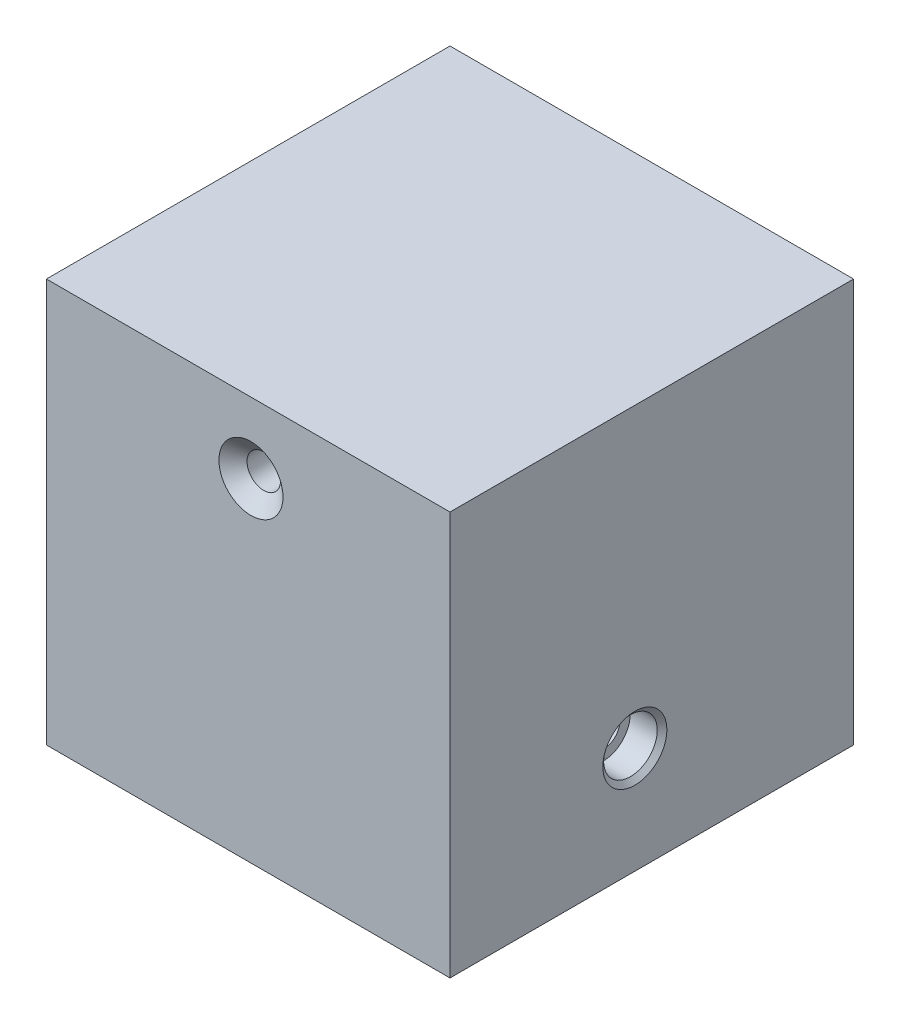
ISO-10303-21;
HEADER;
FILE_DESCRIPTION(('STEP AP214'),'2;1');
FILE_NAME('part.step','',(''),(''),'','','');
FILE_SCHEMA(('AUTOMOTIVE_DESIGN { 1 0 10303 214 1 1 1 1 }'));
ENDSEC;
DATA;
#1=APPLICATION_CONTEXT('core data for automotive mechanical design processes');
#2=APPLICATION_PROTOCOL_DEFINITION('international standard','automotive_design',2000,#1);
#3=PRODUCT_CONTEXT('',#1,'mechanical');
#4=PRODUCT('Part','Part','',(#3));
#5=PRODUCT_RELATED_PRODUCT_CATEGORY('part','',(#4));
#6=PRODUCT_DEFINITION_FORMATION('','',#4);
#7=PRODUCT_DEFINITION_CONTEXT('part definition',#1,'design');
#8=PRODUCT_DEFINITION('design','',#6,#7);
#9=PRODUCT_DEFINITION_SHAPE('','',#8);
#10=(LENGTH_UNIT() NAMED_UNIT(*) SI_UNIT(.MILLI.,.METRE.));
#11=(NAMED_UNIT(*) PLANE_ANGLE_UNIT() SI_UNIT($,.RADIAN.));
#12=(NAMED_UNIT(*) SI_UNIT($,.STERADIAN.) SOLID_ANGLE_UNIT());
#13=UNCERTAINTY_MEASURE_WITH_UNIT(LENGTH_MEASURE(1.E-05),#10,'distance_accuracy_value','');
#14=(GEOMETRIC_REPRESENTATION_CONTEXT(3) GLOBAL_UNCERTAINTY_ASSIGNED_CONTEXT((#13)) GLOBAL_UNIT_ASSIGNED_CONTEXT((#10,
#11,#12)) REPRESENTATION_CONTEXT('',''));
#15=CARTESIAN_POINT('',(0.,0.,0.));
#16=DIRECTION('',(0.,0.,1.));
#17=DIRECTION('',(1.,0.,0.));
#18=AXIS2_PLACEMENT_3D('',#15,#16,#17);
#19=CARTESIAN_POINT('',(101.6,26.8232451806077,55.0625341901142));
#20=DIRECTION('',(1.,0.,0.));
#21=DIRECTION('',(0.,0.,-1.));
#22=AXIS2_PLACEMENT_3D('',#19,#20,#21);
#23=CYLINDRICAL_SURFACE('',#22,4.21639999999999);
#24=CARTESIAN_POINT('',(12.7,26.8232451806077,55.0625341901142));
#25=DIRECTION('',(-1.,0.,0.));
#26=DIRECTION('',(0.,0.,1.));
#27=AXIS2_PLACEMENT_3D('',#24,#25,#26);
#28=CIRCLE('',#27,4.21639999999999);
#29=CARTESIAN_POINT('',(12.7,26.8232451806077,59.2789341901142));
#30=VERTEX_POINT('',#29);
#31=EDGE_CURVE('E120',#30,#30,#28,.F.);
#32=ORIENTED_EDGE('',*,*,#31,.F.);
#33=EDGE_LOOP('',(#32));
#34=FACE_BOUND('',#33,.T.);
#35=CARTESIAN_POINT('',(50.673,26.8232451806077,55.0625341901142));
#36=DIRECTION('',(1.,0.,0.));
#37=DIRECTION('',(0.,0.,-1.));
#38=AXIS2_PLACEMENT_3D('',#35,#36,#37);
#39=CIRCLE('',#38,4.21639999999999);
#40=CARTESIAN_POINT('',(50.673,26.8232451806077,50.8461341901142));
#41=VERTEX_POINT('',#40);
#42=EDGE_CURVE('E11',#41,#41,#39,.F.);
#43=ORIENTED_EDGE('',*,*,#42,.F.);
#44=EDGE_LOOP('',(#43));
#45=FACE_BOUND('',#44,.T.);
#46=ADVANCED_FACE('F41',(#34,#45),#23,.F.);
#47=CARTESIAN_POINT('',(50.927,26.8232451806077,55.0625341901142));
#48=DIRECTION('',(1.,0.,0.));
#49=DIRECTION('',(0.,0.,-1.));
#50=AXIS2_PLACEMENT_3D('',#47,#48,#49);
#51=CIRCLE('',#50,4.2164);
#52=CARTESIAN_POINT('',(50.927,26.8232451806077,50.8461341901142));
#53=VERTEX_POINT('',#52);
#54=EDGE_CURVE('E145',#53,#53,#51,.T.);
#55=ORIENTED_EDGE('',*,*,#54,.F.);
#56=EDGE_LOOP('',(#55));
#57=FACE_BOUND('',#56,.T.);
#58=CARTESIAN_POINT('',(93.6625,26.8232451806077,55.0625341901142));
#59=DIRECTION('',(1.,0.,0.));
#60=DIRECTION('',(0.,0.,-1.));
#61=AXIS2_PLACEMENT_3D('',#58,#59,#60);
#62=CIRCLE('',#61,4.21640000000001);
#63=CARTESIAN_POINT('',(93.6625,26.8232451806077,50.8461341901142));
#64=VERTEX_POINT('',#63);
#65=EDGE_CURVE('E158',#64,#64,#62,.T.);
#66=ORIENTED_EDGE('',*,*,#65,.T.);
#67=EDGE_LOOP('',(#66));
#68=FACE_BOUND('',#67,.T.);
#69=ADVANCED_FACE('F201',(#57,#68),#23,.F.);
#70=CARTESIAN_POINT('',(0.,0.,101.6));
#71=DIRECTION('',(1.,0.,0.));
#72=DIRECTION('',(0.,0.,-1.));
#73=AXIS2_PLACEMENT_3D('',#70,#71,#72);
#74=PLANE('',#73);
#75=CARTESIAN_POINT('',(0.,26.8232451806077,55.0625341901142));
#76=DIRECTION('',(1.,0.,0.));
#77=DIRECTION('',(0.,0.,-1.));
#78=AXIS2_PLACEMENT_3D('',#75,#76,#77);
#79=CIRCLE('',#78,9.46277456392465);
#80=CARTESIAN_POINT('',(0.,26.8232451806077,45.5997596261896));
#81=VERTEX_POINT('',#80);
#82=EDGE_CURVE('E50',#81,#81,#79,.T.);
#83=ORIENTED_EDGE('',*,*,#82,.T.);
#84=EDGE_LOOP('',(#83));
#85=FACE_BOUND('',#84,.T.);
#86=DIRECTION('',(0.,-1.,0.));
#87=VECTOR('',#86,1.);
#88=CARTESIAN_POINT('',(0.,0.,0.));
#89=LINE('',#88,#87);
#90=CARTESIAN_POINT('',(0.,101.6,0.));
#91=VERTEX_POINT('',#90);
#92=CARTESIAN_POINT('',(0.,0.,0.));
#93=VERTEX_POINT('',#92);
#94=EDGE_CURVE('E109',#91,#93,#89,.T.);
#95=ORIENTED_EDGE('',*,*,#94,.T.);
#96=DIRECTION('',(0.,0.,-1.));
#97=VECTOR('',#96,1.);
#98=CARTESIAN_POINT('',(0.,0.,101.6));
#99=LINE('',#98,#97);
#100=CARTESIAN_POINT('',(0.,0.,101.6));
#101=VERTEX_POINT('',#100);
#102=EDGE_CURVE('E100',#101,#93,#99,.T.);
#103=ORIENTED_EDGE('',*,*,#102,.F.);
#104=DIRECTION('',(0.,-1.,0.));
#105=VECTOR('',#104,1.);
#106=CARTESIAN_POINT('',(0.,0.,101.6));
#107=LINE('',#106,#105);
#108=CARTESIAN_POINT('',(0.,101.6,101.6));
#109=VERTEX_POINT('',#108);
#110=EDGE_CURVE('E94',#109,#101,#107,.T.);
#111=ORIENTED_EDGE('',*,*,#110,.F.);
#112=DIRECTION('',(0.,0.,-1.));
#113=VECTOR('',#112,1.);
#114=CARTESIAN_POINT('',(0.,101.6,101.6));
#115=LINE('',#114,#113);
#116=EDGE_CURVE('E105',#109,#91,#115,.T.);
#117=ORIENTED_EDGE('',*,*,#116,.T.);
#118=EDGE_LOOP('',(#95,#103,#111,#117));
#119=FACE_BOUND('',#118,.T.);
#120=ADVANCED_FACE('F129',(#85,#119),#74,.F.);
#121=CARTESIAN_POINT('',(0.,0.,101.6));
#122=DIRECTION('',(0.,1.,0.));
#123=DIRECTION('',(0.,0.,1.));
#124=AXIS2_PLACEMENT_3D('',#121,#122,#123);
#125=PLANE('',#124);
#126=DIRECTION('',(1.,0.,0.));
#127=VECTOR('',#126,1.);
#128=CARTESIAN_POINT('',(0.,0.,0.));
#129=LINE('',#128,#127);
#130=CARTESIAN_POINT('',(101.6,0.,0.));
#131=VERTEX_POINT('',#130);
#132=EDGE_CURVE('E99',#93,#131,#129,.T.);
#133=ORIENTED_EDGE('',*,*,#132,.T.);
#134=DIRECTION('',(0.,0.,-1.));
#135=VECTOR('',#134,1.);
#136=CARTESIAN_POINT('',(101.6,0.,101.6));
#137=LINE('',#136,#135);
#138=CARTESIAN_POINT('',(101.6,0.,101.6));
#139=VERTEX_POINT('',#138);
#140=EDGE_CURVE('E97',#139,#131,#137,.T.);
#141=ORIENTED_EDGE('',*,*,#140,.F.);
#142=DIRECTION('',(1.,0.,0.));
#143=VECTOR('',#142,1.);
#144=CARTESIAN_POINT('',(0.,0.,101.6));
#145=LINE('',#144,#143);
#146=EDGE_CURVE('E89',#101,#139,#145,.T.);
#147=ORIENTED_EDGE('',*,*,#146,.F.);
#148=ORIENTED_EDGE('',*,*,#102,.T.);
#149=EDGE_LOOP('',(#133,#141,#147,#148));
#150=FACE_BOUND('',#149,.T.);
#151=ADVANCED_FACE('F98',(#150),#125,.F.);
#152=CARTESIAN_POINT('',(101.6,0.,101.6));
#153=DIRECTION('',(-1.,0.,0.));
#154=DIRECTION('',(0.,0.,1.));
#155=AXIS2_PLACEMENT_3D('',#152,#153,#154);
#156=PLANE('',#155);
#157=CARTESIAN_POINT('',(101.6,26.8232451806077,55.0625341901142));
#158=DIRECTION('',(1.,0.,0.));
#159=DIRECTION('',(0.,0.,-1.));
#160=AXIS2_PLACEMENT_3D('',#157,#158,#159);
#161=CIRCLE('',#160,8.06450000000001);
#162=CARTESIAN_POINT('',(101.6,26.8232451806077,46.9980341901142));
#163=VERTEX_POINT('',#162);
#164=EDGE_CURVE('E123',#163,#163,#161,.T.);
#165=ORIENTED_EDGE('',*,*,#164,.F.);
#166=EDGE_LOOP('',(#165));
#167=FACE_BOUND('',#166,.T.);
#168=DIRECTION('',(0.,1.,0.));
#169=VECTOR('',#168,1.);
#170=CARTESIAN_POINT('',(101.6,0.,0.));
#171=LINE('',#170,#169);
#172=CARTESIAN_POINT('',(101.6,101.6,0.));
#173=VERTEX_POINT('',#172);
#174=EDGE_CURVE('E75',#131,#173,#171,.T.);
#175=ORIENTED_EDGE('',*,*,#174,.T.);
#176=DIRECTION('',(0.,0.,-1.));
#177=VECTOR('',#176,1.);
#178=CARTESIAN_POINT('',(101.6,101.6,101.6));
#179=LINE('',#178,#177);
#180=CARTESIAN_POINT('',(101.6,101.6,101.6));
#181=VERTEX_POINT('',#180);
#182=EDGE_CURVE('E101',#181,#173,#179,.T.);
#183=ORIENTED_EDGE('',*,*,#182,.F.);
#184=DIRECTION('',(0.,1.,0.));
#185=VECTOR('',#184,1.);
#186=CARTESIAN_POINT('',(101.6,0.,101.6));
#187=LINE('',#186,#185);
#188=EDGE_CURVE('E92',#139,#181,#187,.T.);
#189=ORIENTED_EDGE('',*,*,#188,.F.);
#190=ORIENTED_EDGE('',*,*,#140,.T.);
#191=EDGE_LOOP('',(#175,#183,#189,#190));
#192=FACE_BOUND('',#191,.T.);
#193=ADVANCED_FACE('F103',(#167,#192),#156,.F.);
#194=CARTESIAN_POINT('',(0.,101.6,101.6));
#195=DIRECTION('',(0.,-1.,0.));
#196=DIRECTION('',(0.,0.,-1.));
#197=AXIS2_PLACEMENT_3D('',#194,#195,#196);
#198=PLANE('',#197);
#199=DIRECTION('',(-1.,0.,0.));
#200=VECTOR('',#199,1.);
#201=CARTESIAN_POINT('',(0.,101.6,0.));
#202=LINE('',#201,#200);
#203=EDGE_CURVE('E81',#173,#91,#202,.T.);
#204=ORIENTED_EDGE('',*,*,#203,.T.);
#205=ORIENTED_EDGE('',*,*,#116,.F.);
#206=DIRECTION('',(-1.,0.,0.));
#207=VECTOR('',#206,1.);
#208=CARTESIAN_POINT('',(0.,101.6,101.6));
#209=LINE('',#208,#207);
#210=EDGE_CURVE('E58',#181,#109,#209,.T.);
#211=ORIENTED_EDGE('',*,*,#210,.F.);
#212=ORIENTED_EDGE('',*,*,#182,.T.);
#213=EDGE_LOOP('',(#204,#205,#211,#212));
#214=FACE_BOUND('',#213,.T.);
#215=ADVANCED_FACE('F190',(#214),#198,.F.);
#216=CARTESIAN_POINT('',(0.,0.,101.6));
#217=DIRECTION('',(0.,0.,-1.));
#218=DIRECTION('',(-1.,0.,0.));
#219=AXIS2_PLACEMENT_3D('',#216,#217,#218);
#220=PLANE('',#219);
#221=CARTESIAN_POINT('',(51.4900872333897,83.8414821838995,101.6));
#222=DIRECTION('',(0.,0.,1.));
#223=DIRECTION('',(1.,0.,0.));
#224=AXIS2_PLACEMENT_3D('',#221,#222,#223);
#225=CIRCLE('',#224,8.0645);
#226=CARTESIAN_POINT('',(59.5545872333897,83.8414821838995,101.6));
#227=VERTEX_POINT('',#226);
#228=EDGE_CURVE('E164',#227,#227,#225,.T.);
#229=ORIENTED_EDGE('',*,*,#228,.F.);
#230=EDGE_LOOP('',(#229));
#231=FACE_BOUND('',#230,.T.);
#232=ORIENTED_EDGE('',*,*,#110,.T.);
#233=ORIENTED_EDGE('',*,*,#146,.T.);
#234=ORIENTED_EDGE('',*,*,#188,.T.);
#235=ORIENTED_EDGE('',*,*,#210,.T.);
#236=EDGE_LOOP('',(#232,#233,#234,#235));
#237=FACE_BOUND('',#236,.T.);
#238=ADVANCED_FACE('F90',(#231,#237),#220,.F.);
#239=CARTESIAN_POINT('',(0.,0.,0.));
#240=DIRECTION('',(0.,0.,-1.));
#241=DIRECTION('',(-1.,0.,0.));
#242=AXIS2_PLACEMENT_3D('',#239,#240,#241);
#243=PLANE('',#242);
#244=CARTESIAN_POINT('',(51.4900872333897,83.8414821838995,0.));
#245=DIRECTION('',(0.,0.,1.));
#246=DIRECTION('',(1.,0.,0.));
#247=AXIS2_PLACEMENT_3D('',#244,#245,#246);
#248=CIRCLE('',#247,8.06449999999997);
#249=CARTESIAN_POINT('',(59.5545872333896,83.8414821838995,0.));
#250=VERTEX_POINT('',#249);
#251=EDGE_CURVE('E161',#250,#250,#248,.T.);
#252=ORIENTED_EDGE('',*,*,#251,.T.);
#253=EDGE_LOOP('',(#252));
#254=FACE_BOUND('',#253,.T.);
#255=ORIENTED_EDGE('',*,*,#94,.F.);
#256=ORIENTED_EDGE('',*,*,#203,.F.);
#257=ORIENTED_EDGE('',*,*,#174,.F.);
#258=ORIENTED_EDGE('',*,*,#132,.F.);
#259=EDGE_LOOP('',(#255,#256,#257,#258));
#260=FACE_BOUND('',#259,.T.);
#261=ADVANCED_FACE('F189',(#254,#260),#243,.T.);
#262=CARTESIAN_POINT('',(51.4900872333897,83.8414821838995,3.22893929073329));
#263=DIRECTION('',(0.,0.,-1.));
#264=DIRECTION('',(-1.,0.,0.));
#265=AXIS2_PLACEMENT_3D('',#262,#263,#264);
#266=CONICAL_SURFACE('',#265,4.21639999999998,0.872664625997165);
#267=ORIENTED_EDGE('',*,*,#251,.F.);
#268=EDGE_LOOP('',(#267));
#269=FACE_BOUND('',#268,.T.);
#270=CARTESIAN_POINT('',(51.4900872333897,83.8414821838995,3.22893929073329));
#271=DIRECTION('',(0.,0.,1.));
#272=DIRECTION('',(1.,0.,0.));
#273=AXIS2_PLACEMENT_3D('',#270,#271,#272);
#274=CIRCLE('',#273,4.21639999999998);
#275=CARTESIAN_POINT('',(55.7064872333896,83.8414821838995,3.22893929073329));
#276=VERTEX_POINT('',#275);
#277=EDGE_CURVE('E112',#276,#276,#274,.T.);
#278=ORIENTED_EDGE('',*,*,#277,.T.);
#279=EDGE_LOOP('',(#278));
#280=FACE_BOUND('',#279,.T.);
#281=ADVANCED_FACE('F173',(#269,#280),#266,.F.);
#282=CARTESIAN_POINT('',(51.4900872333897,83.8414821838995,101.6));
#283=DIRECTION('',(0.,0.,1.));
#284=DIRECTION('',(1.,0.,0.));
#285=AXIS2_PLACEMENT_3D('',#282,#283,#284);
#286=CYLINDRICAL_SURFACE('',#285,4.21639999999999);
#287=ORIENTED_EDGE('',*,*,#277,.F.);
#288=EDGE_LOOP('',(#287));
#289=FACE_BOUND('',#288,.T.);
#290=CARTESIAN_POINT('',(51.4900872333897,83.8414821838995,98.3710607092667));
#291=DIRECTION('',(0.,0.,1.));
#292=DIRECTION('',(1.,0.,0.));
#293=AXIS2_PLACEMENT_3D('',#290,#291,#292);
#294=CIRCLE('',#293,4.21639999999999);
#295=CARTESIAN_POINT('',(55.7064872333897,83.8414821838995,98.3710607092667));
#296=VERTEX_POINT('',#295);
#297=EDGE_CURVE('E167',#296,#296,#294,.T.);
#298=ORIENTED_EDGE('',*,*,#297,.T.);
#299=EDGE_LOOP('',(#298));
#300=FACE_BOUND('',#299,.T.);
#301=ADVANCED_FACE('F175',(#289,#300),#286,.F.);
#302=CARTESIAN_POINT('',(51.4900872333897,83.8414821838995,101.6));
#303=DIRECTION('',(0.,0.,1.));
#304=DIRECTION('',(1.,0.,0.));
#305=AXIS2_PLACEMENT_3D('',#302,#303,#304);
#306=CONICAL_SURFACE('',#305,8.0645,0.872664625997167);
#307=ORIENTED_EDGE('',*,*,#297,.F.);
#308=EDGE_LOOP('',(#307));
#309=FACE_BOUND('',#308,.T.);
#310=ORIENTED_EDGE('',*,*,#228,.T.);
#311=EDGE_LOOP('',(#310));
#312=FACE_BOUND('',#311,.T.);
#313=ADVANCED_FACE('F178',(#309,#312),#306,.F.);
#314=CARTESIAN_POINT('',(93.6625,33.5707551806077,55.0625341901142));
#315=DIRECTION('',(-1.,0.,0.));
#316=DIRECTION('',(0.,0.,1.));
#317=AXIS2_PLACEMENT_3D('',#314,#315,#316);
#318=PLANE('',#317);
#319=ORIENTED_EDGE('',*,*,#65,.F.);
#320=EDGE_LOOP('',(#319));
#321=FACE_BOUND('',#320,.T.);
#322=CARTESIAN_POINT('',(93.6625,26.8232451806077,55.0625341901142));
#323=DIRECTION('',(1.,0.,0.));
#324=DIRECTION('',(0.,0.,-1.));
#325=AXIS2_PLACEMENT_3D('',#322,#323,#324);
#326=CIRCLE('',#325,6.74750999999999);
#327=CARTESIAN_POINT('',(93.6625,26.8232451806077,48.3150241901142));
#328=VERTEX_POINT('',#327);
#329=EDGE_CURVE('E155',#328,#328,#326,.T.);
#330=ORIENTED_EDGE('',*,*,#329,.T.);
#331=EDGE_LOOP('',(#330));
#332=FACE_BOUND('',#331,.T.);
#333=ADVANCED_FACE('F184',(#321,#332),#318,.F.);
#334=CARTESIAN_POINT('',(101.6,26.8232451806077,55.0625341901142));
#335=DIRECTION('',(1.,0.,0.));
#336=DIRECTION('',(0.,0.,-1.));
#337=AXIS2_PLACEMENT_3D('',#334,#335,#336);
#338=CYLINDRICAL_SURFACE('',#337,6.74751);
#339=ORIENTED_EDGE('',*,*,#329,.F.);
#340=EDGE_LOOP('',(#339));
#341=FACE_BOUND('',#340,.T.);
#342=CARTESIAN_POINT('',(100.494914176736,26.8232451806077,55.0625341901142));
#343=DIRECTION('',(1.,0.,0.));
#344=DIRECTION('',(0.,0.,-1.));
#345=AXIS2_PLACEMENT_3D('',#342,#343,#344);
#346=CIRCLE('',#345,6.74751);
#347=CARTESIAN_POINT('',(100.494914176736,26.8232451806077,48.3150241901142));
#348=VERTEX_POINT('',#347);
#349=EDGE_CURVE('E152',#348,#348,#346,.T.);
#350=ORIENTED_EDGE('',*,*,#349,.T.);
#351=EDGE_LOOP('',(#350));
#352=FACE_BOUND('',#351,.T.);
#353=ADVANCED_FACE('F233',(#341,#352),#338,.F.);
#354=CARTESIAN_POINT('',(101.6,26.8232451806077,55.0625341901142));
#355=DIRECTION('',(1.,0.,0.));
#356=DIRECTION('',(0.,0.,-1.));
#357=AXIS2_PLACEMENT_3D('',#354,#355,#356);
#358=CONICAL_SURFACE('',#357,8.06450000000001,0.872664625997164);
#359=ORIENTED_EDGE('',*,*,#349,.F.);
#360=EDGE_LOOP('',(#359));
#361=FACE_BOUND('',#360,.T.);
#362=ORIENTED_EDGE('',*,*,#164,.T.);
#363=EDGE_LOOP('',(#362));
#364=FACE_BOUND('',#363,.T.);
#365=ADVANCED_FACE('F231',(#361,#364),#358,.F.);
#366=CARTESIAN_POINT('',(12.7,26.8232451806077,55.0625341901142));
#367=DIRECTION('',(-1.,0.,0.));
#368=DIRECTION('',(0.,0.,1.));
#369=AXIS2_PLACEMENT_3D('',#366,#367,#368);
#370=PLANE('',#369);
#371=CARTESIAN_POINT('',(12.7,26.8232451806077,55.0625341901142));
#372=DIRECTION('',(-1.,0.,0.));
#373=DIRECTION('',(0.,0.,1.));
#374=AXIS2_PLACEMENT_3D('',#371,#372,#373);
#375=CIRCLE('',#374,6.92277456392466);
#376=CARTESIAN_POINT('',(12.7,26.8232451806077,61.9853087540389));
#377=VERTEX_POINT('',#376);
#378=EDGE_CURVE('E124',#377,#377,#375,.T.);
#379=ORIENTED_EDGE('',*,*,#378,.T.);
#380=EDGE_LOOP('',(#379));
#381=FACE_BOUND('',#380,.T.);
#382=ORIENTED_EDGE('',*,*,#31,.T.);
#383=EDGE_LOOP('',(#382));
#384=FACE_BOUND('',#383,.T.);
#385=ADVANCED_FACE('F140',(#381,#384),#370,.T.);
#386=CARTESIAN_POINT('',(12.7,26.8232451806077,55.0625341901142));
#387=DIRECTION('',(-1.,0.,0.));
#388=DIRECTION('',(0.,0.,1.));
#389=AXIS2_PLACEMENT_3D('',#386,#387,#388);
#390=CYLINDRICAL_SURFACE('',#389,6.92277456392466);
#391=CARTESIAN_POINT('',(2.53999999999997,26.8232451806077,55.0625341901142));
#392=DIRECTION('',(1.,0.,0.));
#393=DIRECTION('',(0.,0.,-1.));
#394=AXIS2_PLACEMENT_3D('',#391,#392,#393);
#395=CIRCLE('',#394,6.92277456392466);
#396=CARTESIAN_POINT('',(2.53999999999997,26.8232451806077,48.1397596261896));
#397=VERTEX_POINT('',#396);
#398=EDGE_CURVE('E119',#397,#397,#395,.F.);
#399=ORIENTED_EDGE('',*,*,#398,.T.);
#400=EDGE_LOOP('',(#399));
#401=FACE_BOUND('',#400,.T.);
#402=ORIENTED_EDGE('',*,*,#378,.F.);
#403=EDGE_LOOP('',(#402));
#404=FACE_BOUND('',#403,.T.);
#405=ADVANCED_FACE('F135',(#401,#404),#390,.F.);
#406=CARTESIAN_POINT('',(2.53999999999997,26.8232451806077,55.0625341901142));
#407=DIRECTION('',(-1.,0.,0.));
#408=DIRECTION('',(0.,0.,1.));
#409=AXIS2_PLACEMENT_3D('',#406,#407,#408);
#410=CONICAL_SURFACE('',#409,6.92277456392466,0.785398163397452);
#411=ORIENTED_EDGE('',*,*,#82,.F.);
#412=EDGE_LOOP('',(#411));
#413=FACE_BOUND('',#412,.T.);
#414=ORIENTED_EDGE('',*,*,#398,.F.);
#415=EDGE_LOOP('',(#414));
#416=FACE_BOUND('',#415,.T.);
#417=ADVANCED_FACE('F43',(#413,#416),#410,.F.);
#418=CARTESIAN_POINT('',(50.673,26.8232451806077,55.0625341901142));
#419=DIRECTION('',(1.,0.,0.));
#420=DIRECTION('',(0.,0.,-1.));
#421=AXIS2_PLACEMENT_3D('',#418,#419,#420);
#422=PLANE('',#421);
#423=ORIENTED_EDGE('',*,*,#42,.T.);
#424=EDGE_LOOP('',(#423));
#425=FACE_BOUND('',#424,.T.);
#426=ADVANCED_FACE('F134',(#425),#422,.F.);
#427=CARTESIAN_POINT('',(50.927,26.8232451806077,55.0625341901142));
#428=DIRECTION('',(1.,0.,0.));
#429=DIRECTION('',(0.,0.,-1.));
#430=AXIS2_PLACEMENT_3D('',#427,#428,#429);
#431=PLANE('',#430);
#432=ORIENTED_EDGE('',*,*,#54,.T.);
#433=EDGE_LOOP('',(#432));
#434=FACE_BOUND('',#433,.T.);
#435=ADVANCED_FACE('F246',(#434),#431,.T.);
#436=CLOSED_SHELL('',(#46,#69,#120,#151,#193,#215,#238,#261,#281,#301,#313,#333,#353,#365,#385,
#405,#417,#426,#435));
#437=MANIFOLD_SOLID_BREP('B2',#436);
#438=ADVANCED_BREP_SHAPE_REPRESENTATION('',(#18,#437),#14);
#439=SHAPE_DEFINITION_REPRESENTATION(#9,#438);
ENDSEC;
END-ISO-10303-21;
